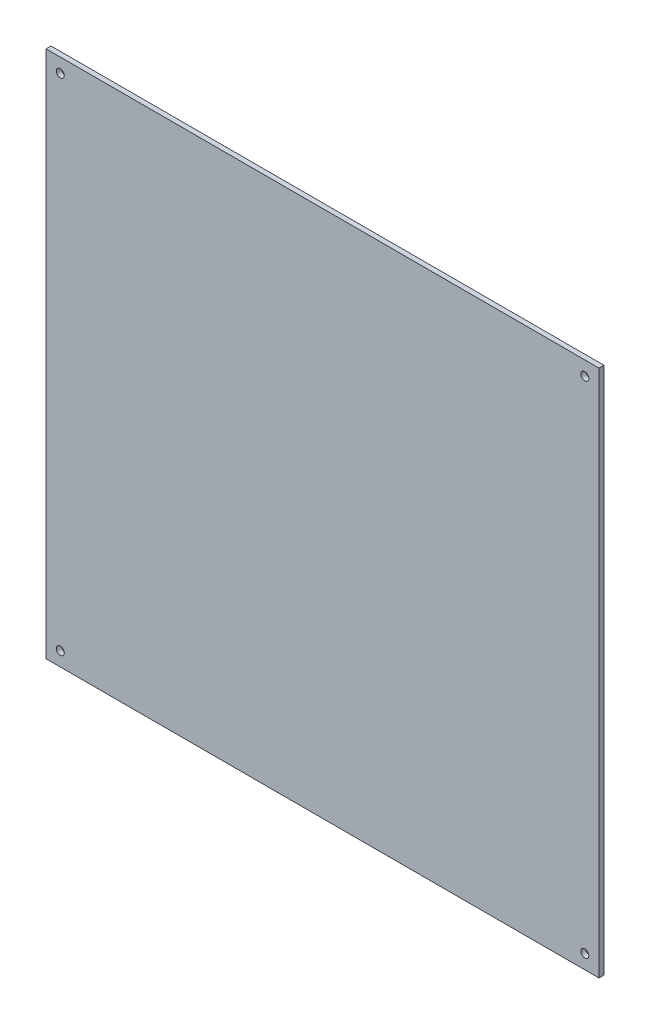
ISO-10303-21;
HEADER;
FILE_DESCRIPTION(('STEP AP214'),'2;1');
FILE_NAME('part.step','',(''),(''),'','','');
FILE_SCHEMA(('AUTOMOTIVE_DESIGN { 1 0 10303 214 1 1 1 1 }'));
ENDSEC;
DATA;
#1=APPLICATION_CONTEXT('core data for automotive mechanical design processes');
#2=APPLICATION_PROTOCOL_DEFINITION('international standard','automotive_design',2000,#1);
#3=PRODUCT_CONTEXT('',#1,'mechanical');
#4=PRODUCT('Part','Part','',(#3));
#5=PRODUCT_RELATED_PRODUCT_CATEGORY('part','',(#4));
#6=PRODUCT_DEFINITION_FORMATION('','',#4);
#7=PRODUCT_DEFINITION_CONTEXT('part definition',#1,'design');
#8=PRODUCT_DEFINITION('design','',#6,#7);
#9=PRODUCT_DEFINITION_SHAPE('','',#8);
#10=(LENGTH_UNIT() NAMED_UNIT(*) SI_UNIT(.MILLI.,.METRE.));
#11=(NAMED_UNIT(*) PLANE_ANGLE_UNIT() SI_UNIT($,.RADIAN.));
#12=(NAMED_UNIT(*) SI_UNIT($,.STERADIAN.) SOLID_ANGLE_UNIT());
#13=UNCERTAINTY_MEASURE_WITH_UNIT(LENGTH_MEASURE(1.E-05),#10,'distance_accuracy_value','');
#14=(GEOMETRIC_REPRESENTATION_CONTEXT(3) GLOBAL_UNCERTAINTY_ASSIGNED_CONTEXT((#13)) GLOBAL_UNIT_ASSIGNED_CONTEXT((#10,
#11,#12)) REPRESENTATION_CONTEXT('',''));
#15=CARTESIAN_POINT('',(0.,0.,0.));
#16=DIRECTION('',(0.,0.,1.));
#17=DIRECTION('',(1.,0.,0.));
#18=AXIS2_PLACEMENT_3D('',#15,#16,#17);
#19=CARTESIAN_POINT('',(0.,0.,4.));
#20=DIRECTION('',(0.,0.,1.));
#21=DIRECTION('',(1.,0.,0.));
#22=AXIS2_PLACEMENT_3D('',#19,#20,#21);
#23=PLANE('',#22);
#24=CARTESIAN_POINT('',(-437.5,11.5000000000001,4.));
#25=DIRECTION('',(0.,0.,1.));
#26=DIRECTION('',(-1.,0.,0.));
#27=AXIS2_PLACEMENT_3D('',#24,#25,#26);
#28=CIRCLE('',#27,3.24999999999995);
#29=CARTESIAN_POINT('',(-440.75,11.5000000000001,4.));
#30=VERTEX_POINT('',#29);
#31=EDGE_CURVE('E155',#30,#30,#28,.T.);
#32=ORIENTED_EDGE('',*,*,#31,.F.);
#33=EDGE_LOOP('',(#32));
#34=FACE_BOUND('',#33,.T.);
#35=CARTESIAN_POINT('',(-437.5,417.5,4.));
#36=DIRECTION('',(0.,0.,1.));
#37=DIRECTION('',(1.,0.,0.));
#38=AXIS2_PLACEMENT_3D('',#35,#36,#37);
#39=CIRCLE('',#38,3.24999999999995);
#40=CARTESIAN_POINT('',(-434.25,417.5,4.));
#41=VERTEX_POINT('',#40);
#42=EDGE_CURVE('E124',#41,#41,#39,.T.);
#43=ORIENTED_EDGE('',*,*,#42,.F.);
#44=EDGE_LOOP('',(#43));
#45=FACE_BOUND('',#44,.T.);
#46=DIRECTION('',(0.,1.,0.));
#47=VECTOR('',#46,1.);
#48=CARTESIAN_POINT('',(0.,0.,4.));
#49=LINE('',#48,#47);
#50=CARTESIAN_POINT('',(0.,0.,4.));
#51=VERTEX_POINT('',#50);
#52=CARTESIAN_POINT('',(-1.66533453693773E-13,429.,4.));
#53=VERTEX_POINT('',#52);
#54=EDGE_CURVE('E104',#51,#53,#49,.T.);
#55=ORIENTED_EDGE('',*,*,#54,.T.);
#56=DIRECTION('',(-1.,0.,0.));
#57=VECTOR('',#56,1.);
#58=CARTESIAN_POINT('',(-1.66533453693773E-13,429.,4.));
#59=LINE('',#58,#57);
#60=CARTESIAN_POINT('',(-449.,429.,4.));
#61=VERTEX_POINT('',#60);
#62=EDGE_CURVE('E98',#53,#61,#59,.T.);
#63=ORIENTED_EDGE('',*,*,#62,.T.);
#64=DIRECTION('',(0.,-1.,0.));
#65=VECTOR('',#64,1.);
#66=CARTESIAN_POINT('',(-449.,0.,4.));
#67=LINE('',#66,#65);
#68=CARTESIAN_POINT('',(-449.,0.,4.));
#69=VERTEX_POINT('',#68);
#70=EDGE_CURVE('E102',#61,#69,#67,.T.);
#71=ORIENTED_EDGE('',*,*,#70,.T.);
#72=DIRECTION('',(1.,0.,0.));
#73=VECTOR('',#72,1.);
#74=CARTESIAN_POINT('',(0.,0.,4.));
#75=LINE('',#74,#73);
#76=EDGE_CURVE('E66',#69,#51,#75,.T.);
#77=ORIENTED_EDGE('',*,*,#76,.T.);
#78=EDGE_LOOP('',(#55,#63,#71,#77));
#79=FACE_BOUND('',#78,.T.);
#80=CARTESIAN_POINT('',(-11.5000000000001,417.5,4.));
#81=DIRECTION('',(0.,0.,1.));
#82=DIRECTION('',(-1.,0.,0.));
#83=AXIS2_PLACEMENT_3D('',#80,#81,#82);
#84=CIRCLE('',#83,3.25);
#85=CARTESIAN_POINT('',(-14.7500000000001,417.5,4.));
#86=VERTEX_POINT('',#85);
#87=EDGE_CURVE('E146',#86,#86,#84,.T.);
#88=ORIENTED_EDGE('',*,*,#87,.F.);
#89=EDGE_LOOP('',(#88));
#90=FACE_BOUND('',#89,.T.);
#91=CARTESIAN_POINT('',(-11.5000000000001,11.5000000000002,4.));
#92=DIRECTION('',(0.,0.,1.));
#93=DIRECTION('',(1.,0.,0.));
#94=AXIS2_PLACEMENT_3D('',#91,#92,#93);
#95=CIRCLE('',#94,3.25);
#96=CARTESIAN_POINT('',(-8.25000000000012,11.5000000000002,4.));
#97=VERTEX_POINT('',#96);
#98=EDGE_CURVE('E163',#97,#97,#95,.T.);
#99=ORIENTED_EDGE('',*,*,#98,.F.);
#100=EDGE_LOOP('',(#99));
#101=FACE_BOUND('',#100,.T.);
#102=ADVANCED_FACE('F48',(#34,#45,#79,#90,#101),#23,.T.);
#103=CARTESIAN_POINT('',(0.,0.,0.));
#104=DIRECTION('',(0.,0.,1.));
#105=DIRECTION('',(1.,0.,0.));
#106=AXIS2_PLACEMENT_3D('',#103,#104,#105);
#107=PLANE('',#106);
#108=DIRECTION('',(0.,1.,0.));
#109=VECTOR('',#108,1.);
#110=CARTESIAN_POINT('',(0.,0.,0.));
#111=LINE('',#110,#109);
#112=CARTESIAN_POINT('',(0.,0.,0.));
#113=VERTEX_POINT('',#112);
#114=CARTESIAN_POINT('',(-1.66533453693773E-13,429.,0.));
#115=VERTEX_POINT('',#114);
#116=EDGE_CURVE('E120',#113,#115,#111,.T.);
#117=ORIENTED_EDGE('',*,*,#116,.F.);
#118=DIRECTION('',(1.,0.,0.));
#119=VECTOR('',#118,1.);
#120=CARTESIAN_POINT('',(0.,0.,0.));
#121=LINE('',#120,#119);
#122=CARTESIAN_POINT('',(-449.,0.,0.));
#123=VERTEX_POINT('',#122);
#124=EDGE_CURVE('E91',#123,#113,#121,.T.);
#125=ORIENTED_EDGE('',*,*,#124,.F.);
#126=DIRECTION('',(0.,-1.,0.));
#127=VECTOR('',#126,1.);
#128=CARTESIAN_POINT('',(-449.,0.,0.));
#129=LINE('',#128,#127);
#130=CARTESIAN_POINT('',(-449.,429.,0.));
#131=VERTEX_POINT('',#130);
#132=EDGE_CURVE('E85',#131,#123,#129,.T.);
#133=ORIENTED_EDGE('',*,*,#132,.F.);
#134=DIRECTION('',(-1.,0.,0.));
#135=VECTOR('',#134,1.);
#136=CARTESIAN_POINT('',(-1.66533453693773E-13,429.,0.));
#137=LINE('',#136,#135);
#138=EDGE_CURVE('E109',#115,#131,#137,.T.);
#139=ORIENTED_EDGE('',*,*,#138,.F.);
#140=EDGE_LOOP('',(#117,#125,#133,#139));
#141=FACE_BOUND('',#140,.T.);
#142=CARTESIAN_POINT('',(-437.5,417.5,0.));
#143=DIRECTION('',(0.,0.,1.));
#144=DIRECTION('',(1.,0.,0.));
#145=AXIS2_PLACEMENT_3D('',#142,#143,#144);
#146=CIRCLE('',#145,3.24999999999995);
#147=CARTESIAN_POINT('',(-434.25,417.5,0.));
#148=VERTEX_POINT('',#147);
#149=EDGE_CURVE('E143',#148,#148,#146,.T.);
#150=ORIENTED_EDGE('',*,*,#149,.T.);
#151=EDGE_LOOP('',(#150));
#152=FACE_BOUND('',#151,.T.);
#153=CARTESIAN_POINT('',(-11.5000000000001,417.5,0.));
#154=DIRECTION('',(0.,0.,1.));
#155=DIRECTION('',(-1.,0.,0.));
#156=AXIS2_PLACEMENT_3D('',#153,#154,#155);
#157=CIRCLE('',#156,3.25);
#158=CARTESIAN_POINT('',(-14.7500000000001,417.5,0.));
#159=VERTEX_POINT('',#158);
#160=EDGE_CURVE('E151',#159,#159,#157,.T.);
#161=ORIENTED_EDGE('',*,*,#160,.T.);
#162=EDGE_LOOP('',(#161));
#163=FACE_BOUND('',#162,.T.);
#164=CARTESIAN_POINT('',(-437.5,11.5000000000001,0.));
#165=DIRECTION('',(0.,0.,1.));
#166=DIRECTION('',(-1.,0.,0.));
#167=AXIS2_PLACEMENT_3D('',#164,#165,#166);
#168=CIRCLE('',#167,3.24999999999995);
#169=CARTESIAN_POINT('',(-440.75,11.5000000000001,0.));
#170=VERTEX_POINT('',#169);
#171=EDGE_CURVE('E159',#170,#170,#168,.T.);
#172=ORIENTED_EDGE('',*,*,#171,.T.);
#173=EDGE_LOOP('',(#172));
#174=FACE_BOUND('',#173,.T.);
#175=CARTESIAN_POINT('',(-11.5000000000001,11.5000000000002,0.));
#176=DIRECTION('',(0.,0.,1.));
#177=DIRECTION('',(1.,0.,0.));
#178=AXIS2_PLACEMENT_3D('',#175,#176,#177);
#179=CIRCLE('',#178,3.25);
#180=CARTESIAN_POINT('',(-8.25000000000012,11.5000000000002,0.));
#181=VERTEX_POINT('',#180);
#182=EDGE_CURVE('E168',#181,#181,#179,.T.);
#183=ORIENTED_EDGE('',*,*,#182,.T.);
#184=EDGE_LOOP('',(#183));
#185=FACE_BOUND('',#184,.T.);
#186=ADVANCED_FACE('F138',(#141,#152,#163,#174,#185),#107,.F.);
#187=CARTESIAN_POINT('',(0.,0.,4.));
#188=DIRECTION('',(-1.,0.,0.));
#189=DIRECTION('',(0.,-1.,0.));
#190=AXIS2_PLACEMENT_3D('',#187,#188,#189);
#191=PLANE('',#190);
#192=ORIENTED_EDGE('',*,*,#116,.T.);
#193=DIRECTION('',(0.,0.,-1.));
#194=VECTOR('',#193,1.);
#195=CARTESIAN_POINT('',(-1.66533453693773E-13,429.,4.));
#196=LINE('',#195,#194);
#197=EDGE_CURVE('E12',#53,#115,#196,.T.);
#198=ORIENTED_EDGE('',*,*,#197,.F.);
#199=ORIENTED_EDGE('',*,*,#54,.F.);
#200=DIRECTION('',(0.,0.,-1.));
#201=VECTOR('',#200,1.);
#202=CARTESIAN_POINT('',(0.,0.,4.));
#203=LINE('',#202,#201);
#204=EDGE_CURVE('E116',#51,#113,#203,.T.);
#205=ORIENTED_EDGE('',*,*,#204,.T.);
#206=EDGE_LOOP('',(#192,#198,#199,#205));
#207=FACE_BOUND('',#206,.T.);
#208=ADVANCED_FACE('F50',(#207),#191,.F.);
#209=CARTESIAN_POINT('',(-1.66533453693773E-13,429.,4.));
#210=DIRECTION('',(0.,-1.,0.));
#211=DIRECTION('',(1.,0.,0.));
#212=AXIS2_PLACEMENT_3D('',#209,#210,#211);
#213=PLANE('',#212);
#214=ORIENTED_EDGE('',*,*,#138,.T.);
#215=DIRECTION('',(0.,0.,-1.));
#216=VECTOR('',#215,1.);
#217=CARTESIAN_POINT('',(-449.,429.,4.));
#218=LINE('',#217,#216);
#219=EDGE_CURVE('E58',#61,#131,#218,.T.);
#220=ORIENTED_EDGE('',*,*,#219,.F.);
#221=ORIENTED_EDGE('',*,*,#62,.F.);
#222=ORIENTED_EDGE('',*,*,#197,.T.);
#223=EDGE_LOOP('',(#214,#220,#221,#222));
#224=FACE_BOUND('',#223,.T.);
#225=ADVANCED_FACE('F108',(#224),#213,.F.);
#226=CARTESIAN_POINT('',(-449.,0.,4.));
#227=DIRECTION('',(1.,0.,0.));
#228=DIRECTION('',(0.,1.,0.));
#229=AXIS2_PLACEMENT_3D('',#226,#227,#228);
#230=PLANE('',#229);
#231=ORIENTED_EDGE('',*,*,#132,.T.);
#232=DIRECTION('',(0.,0.,-1.));
#233=VECTOR('',#232,1.);
#234=CARTESIAN_POINT('',(-449.,0.,4.));
#235=LINE('',#234,#233);
#236=EDGE_CURVE('E111',#69,#123,#235,.T.);
#237=ORIENTED_EDGE('',*,*,#236,.F.);
#238=ORIENTED_EDGE('',*,*,#70,.F.);
#239=ORIENTED_EDGE('',*,*,#219,.T.);
#240=EDGE_LOOP('',(#231,#237,#238,#239));
#241=FACE_BOUND('',#240,.T.);
#242=ADVANCED_FACE('F112',(#241),#230,.F.);
#243=CARTESIAN_POINT('',(0.,0.,4.));
#244=DIRECTION('',(0.,1.,0.));
#245=DIRECTION('',(-1.,0.,0.));
#246=AXIS2_PLACEMENT_3D('',#243,#244,#245);
#247=PLANE('',#246);
#248=ORIENTED_EDGE('',*,*,#124,.T.);
#249=ORIENTED_EDGE('',*,*,#204,.F.);
#250=ORIENTED_EDGE('',*,*,#76,.F.);
#251=ORIENTED_EDGE('',*,*,#236,.T.);
#252=EDGE_LOOP('',(#248,#249,#250,#251));
#253=FACE_BOUND('',#252,.T.);
#254=ADVANCED_FACE('F134',(#253),#247,.F.);
#255=CARTESIAN_POINT('',(-437.5,417.5,4.));
#256=DIRECTION('',(0.,0.,-1.));
#257=DIRECTION('',(-1.,0.,0.));
#258=AXIS2_PLACEMENT_3D('',#255,#256,#257);
#259=CYLINDRICAL_SURFACE('',#258,3.24999999999995);
#260=ORIENTED_EDGE('',*,*,#42,.T.);
#261=EDGE_LOOP('',(#260));
#262=FACE_BOUND('',#261,.T.);
#263=ORIENTED_EDGE('',*,*,#149,.F.);
#264=EDGE_LOOP('',(#263));
#265=FACE_BOUND('',#264,.T.);
#266=ADVANCED_FACE('F201',(#262,#265),#259,.F.);
#267=CARTESIAN_POINT('',(-11.5000000000001,417.5,4.));
#268=DIRECTION('',(0.,0.,-1.));
#269=DIRECTION('',(-1.,0.,0.));
#270=AXIS2_PLACEMENT_3D('',#267,#268,#269);
#271=CYLINDRICAL_SURFACE('',#270,3.25);
#272=ORIENTED_EDGE('',*,*,#87,.T.);
#273=EDGE_LOOP('',(#272));
#274=FACE_BOUND('',#273,.T.);
#275=ORIENTED_EDGE('',*,*,#160,.F.);
#276=EDGE_LOOP('',(#275));
#277=FACE_BOUND('',#276,.T.);
#278=ADVANCED_FACE('F188',(#274,#277),#271,.F.);
#279=CARTESIAN_POINT('',(-437.5,11.5000000000001,4.));
#280=DIRECTION('',(0.,0.,-1.));
#281=DIRECTION('',(-1.,0.,0.));
#282=AXIS2_PLACEMENT_3D('',#279,#280,#281);
#283=CYLINDRICAL_SURFACE('',#282,3.24999999999995);
#284=ORIENTED_EDGE('',*,*,#31,.T.);
#285=EDGE_LOOP('',(#284));
#286=FACE_BOUND('',#285,.T.);
#287=ORIENTED_EDGE('',*,*,#171,.F.);
#288=EDGE_LOOP('',(#287));
#289=FACE_BOUND('',#288,.T.);
#290=ADVANCED_FACE('F183',(#286,#289),#283,.F.);
#291=CARTESIAN_POINT('',(-11.5000000000001,11.5000000000002,4.));
#292=DIRECTION('',(0.,0.,-1.));
#293=DIRECTION('',(-1.,0.,0.));
#294=AXIS2_PLACEMENT_3D('',#291,#292,#293);
#295=CYLINDRICAL_SURFACE('',#294,3.25);
#296=ORIENTED_EDGE('',*,*,#98,.T.);
#297=EDGE_LOOP('',(#296));
#298=FACE_BOUND('',#297,.T.);
#299=ORIENTED_EDGE('',*,*,#182,.F.);
#300=EDGE_LOOP('',(#299));
#301=FACE_BOUND('',#300,.T.);
#302=ADVANCED_FACE('F181',(#298,#301),#295,.F.);
#303=CLOSED_SHELL('',(#102,#186,#208,#225,#242,#254,#266,#278,#290,#302));
#304=MANIFOLD_SOLID_BREP('B2',#303);
#305=ADVANCED_BREP_SHAPE_REPRESENTATION('',(#18,#304),#14);
#306=SHAPE_DEFINITION_REPRESENTATION(#9,#305);
ENDSEC;
END-ISO-10303-21;
